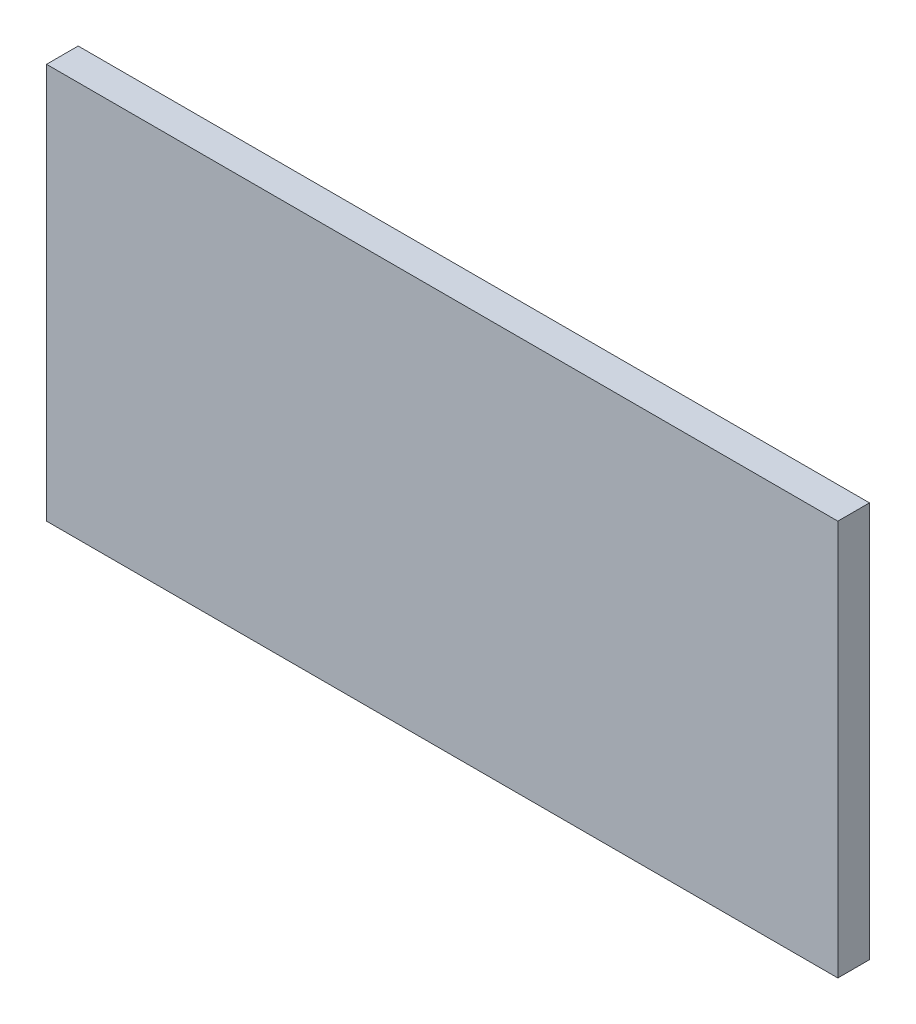
ISO-10303-21;
HEADER;
FILE_DESCRIPTION(('STEP AP214'),'2;1');
FILE_NAME('part.step','',(''),(''),'','','');
FILE_SCHEMA(('AUTOMOTIVE_DESIGN { 1 0 10303 214 1 1 1 1 }'));
ENDSEC;
DATA;
#1=APPLICATION_CONTEXT('core data for automotive mechanical design processes');
#2=APPLICATION_PROTOCOL_DEFINITION('international standard','automotive_design',2000,#1);
#3=PRODUCT_CONTEXT('',#1,'mechanical');
#4=PRODUCT('Part','Part','',(#3));
#5=PRODUCT_RELATED_PRODUCT_CATEGORY('part','',(#4));
#6=PRODUCT_DEFINITION_FORMATION('','',#4);
#7=PRODUCT_DEFINITION_CONTEXT('part definition',#1,'design');
#8=PRODUCT_DEFINITION('design','',#6,#7);
#9=PRODUCT_DEFINITION_SHAPE('','',#8);
#10=(LENGTH_UNIT() NAMED_UNIT(*) SI_UNIT(.MILLI.,.METRE.));
#11=(NAMED_UNIT(*) PLANE_ANGLE_UNIT() SI_UNIT($,.RADIAN.));
#12=(NAMED_UNIT(*) SI_UNIT($,.STERADIAN.) SOLID_ANGLE_UNIT());
#13=UNCERTAINTY_MEASURE_WITH_UNIT(LENGTH_MEASURE(1.E-05),#10,'distance_accuracy_value','');
#14=(GEOMETRIC_REPRESENTATION_CONTEXT(3) GLOBAL_UNCERTAINTY_ASSIGNED_CONTEXT((#13)) GLOBAL_UNIT_ASSIGNED_CONTEXT((#10,
#11,#12)) REPRESENTATION_CONTEXT('',''));
#15=CARTESIAN_POINT('',(0.,0.,0.));
#16=DIRECTION('',(0.,0.,1.));
#17=DIRECTION('',(1.,0.,0.));
#18=AXIS2_PLACEMENT_3D('',#15,#16,#17);
#19=CARTESIAN_POINT('',(250.,-125.,20.));
#20=DIRECTION('',(-1.,0.,0.));
#21=DIRECTION('',(0.,0.,1.));
#22=AXIS2_PLACEMENT_3D('',#19,#20,#21);
#23=PLANE('',#22);
#24=DIRECTION('',(0.,1.,0.));
#25=VECTOR('',#24,1.);
#26=CARTESIAN_POINT('',(250.,-125.,0.));
#27=LINE('',#26,#25);
#28=CARTESIAN_POINT('',(250.,-125.,0.));
#29=VERTEX_POINT('',#28);
#30=CARTESIAN_POINT('',(250.,125.,0.));
#31=VERTEX_POINT('',#30);
#32=EDGE_CURVE('E107',#29,#31,#27,.T.);
#33=ORIENTED_EDGE('',*,*,#32,.T.);
#34=DIRECTION('',(0.,0.,-1.));
#35=VECTOR('',#34,1.);
#36=CARTESIAN_POINT('',(250.,125.,20.));
#37=LINE('',#36,#35);
#38=CARTESIAN_POINT('',(250.,125.,20.));
#39=VERTEX_POINT('',#38);
#40=EDGE_CURVE('E11',#39,#31,#37,.T.);
#41=ORIENTED_EDGE('',*,*,#40,.F.);
#42=DIRECTION('',(0.,1.,0.));
#43=VECTOR('',#42,1.);
#44=CARTESIAN_POINT('',(250.,-125.,20.));
#45=LINE('',#44,#43);
#46=CARTESIAN_POINT('',(250.,-125.,20.));
#47=VERTEX_POINT('',#46);
#48=EDGE_CURVE('E91',#47,#39,#45,.T.);
#49=ORIENTED_EDGE('',*,*,#48,.F.);
#50=DIRECTION('',(0.,0.,-1.));
#51=VECTOR('',#50,1.);
#52=CARTESIAN_POINT('',(250.,-125.,20.));
#53=LINE('',#52,#51);
#54=EDGE_CURVE('E103',#47,#29,#53,.T.);
#55=ORIENTED_EDGE('',*,*,#54,.T.);
#56=EDGE_LOOP('',(#33,#41,#49,#55));
#57=FACE_BOUND('',#56,.T.);
#58=ADVANCED_FACE('F39',(#57),#23,.F.);
#59=CARTESIAN_POINT('',(-250.,125.,20.));
#60=DIRECTION('',(0.,-1.,0.));
#61=DIRECTION('',(0.,0.,-1.));
#62=AXIS2_PLACEMENT_3D('',#59,#60,#61);
#63=PLANE('',#62);
#64=DIRECTION('',(-1.,0.,0.));
#65=VECTOR('',#64,1.);
#66=CARTESIAN_POINT('',(-250.,125.,0.));
#67=LINE('',#66,#65);
#68=CARTESIAN_POINT('',(-250.,125.,0.));
#69=VERTEX_POINT('',#68);
#70=EDGE_CURVE('E96',#31,#69,#67,.T.);
#71=ORIENTED_EDGE('',*,*,#70,.T.);
#72=DIRECTION('',(0.,0.,-1.));
#73=VECTOR('',#72,1.);
#74=CARTESIAN_POINT('',(-250.,125.,20.));
#75=LINE('',#74,#73);
#76=CARTESIAN_POINT('',(-250.,125.,20.));
#77=VERTEX_POINT('',#76);
#78=EDGE_CURVE('E48',#77,#69,#75,.T.);
#79=ORIENTED_EDGE('',*,*,#78,.F.);
#80=DIRECTION('',(-1.,0.,0.));
#81=VECTOR('',#80,1.);
#82=CARTESIAN_POINT('',(-250.,125.,20.));
#83=LINE('',#82,#81);
#84=EDGE_CURVE('E86',#39,#77,#83,.T.);
#85=ORIENTED_EDGE('',*,*,#84,.F.);
#86=ORIENTED_EDGE('',*,*,#40,.T.);
#87=EDGE_LOOP('',(#71,#79,#85,#86));
#88=FACE_BOUND('',#87,.T.);
#89=ADVANCED_FACE('F95',(#88),#63,.F.);
#90=CARTESIAN_POINT('',(-250.,-125.,20.));
#91=DIRECTION('',(1.,0.,0.));
#92=DIRECTION('',(0.,0.,-1.));
#93=AXIS2_PLACEMENT_3D('',#90,#91,#92);
#94=PLANE('',#93);
#95=DIRECTION('',(0.,-1.,0.));
#96=VECTOR('',#95,1.);
#97=CARTESIAN_POINT('',(-250.,-125.,0.));
#98=LINE('',#97,#96);
#99=CARTESIAN_POINT('',(-250.,-125.,0.));
#100=VERTEX_POINT('',#99);
#101=EDGE_CURVE('E73',#69,#100,#98,.T.);
#102=ORIENTED_EDGE('',*,*,#101,.T.);
#103=DIRECTION('',(0.,0.,-1.));
#104=VECTOR('',#103,1.);
#105=CARTESIAN_POINT('',(-250.,-125.,20.));
#106=LINE('',#105,#104);
#107=CARTESIAN_POINT('',(-250.,-125.,20.));
#108=VERTEX_POINT('',#107);
#109=EDGE_CURVE('E98',#108,#100,#106,.T.);
#110=ORIENTED_EDGE('',*,*,#109,.F.);
#111=DIRECTION('',(0.,-1.,0.));
#112=VECTOR('',#111,1.);
#113=CARTESIAN_POINT('',(-250.,-125.,20.));
#114=LINE('',#113,#112);
#115=EDGE_CURVE('E89',#77,#108,#114,.T.);
#116=ORIENTED_EDGE('',*,*,#115,.F.);
#117=ORIENTED_EDGE('',*,*,#78,.T.);
#118=EDGE_LOOP('',(#102,#110,#116,#117));
#119=FACE_BOUND('',#118,.T.);
#120=ADVANCED_FACE('F99',(#119),#94,.F.);
#121=CARTESIAN_POINT('',(-250.,-125.,20.));
#122=DIRECTION('',(0.,1.,0.));
#123=DIRECTION('',(0.,0.,1.));
#124=AXIS2_PLACEMENT_3D('',#121,#122,#123);
#125=PLANE('',#124);
#126=DIRECTION('',(1.,0.,0.));
#127=VECTOR('',#126,1.);
#128=CARTESIAN_POINT('',(-250.,-125.,0.));
#129=LINE('',#128,#127);
#130=EDGE_CURVE('E79',#100,#29,#129,.T.);
#131=ORIENTED_EDGE('',*,*,#130,.T.);
#132=ORIENTED_EDGE('',*,*,#54,.F.);
#133=DIRECTION('',(1.,0.,0.));
#134=VECTOR('',#133,1.);
#135=CARTESIAN_POINT('',(-250.,-125.,20.));
#136=LINE('',#135,#134);
#137=EDGE_CURVE('E56',#108,#47,#136,.T.);
#138=ORIENTED_EDGE('',*,*,#137,.F.);
#139=ORIENTED_EDGE('',*,*,#109,.T.);
#140=EDGE_LOOP('',(#131,#132,#138,#139));
#141=FACE_BOUND('',#140,.T.);
#142=ADVANCED_FACE('F120',(#141),#125,.F.);
#143=CARTESIAN_POINT('',(0.,0.,20.));
#144=DIRECTION('',(0.,0.,-1.));
#145=DIRECTION('',(-1.,0.,0.));
#146=AXIS2_PLACEMENT_3D('',#143,#144,#145);
#147=PLANE('',#146);
#148=ORIENTED_EDGE('',*,*,#48,.T.);
#149=ORIENTED_EDGE('',*,*,#84,.T.);
#150=ORIENTED_EDGE('',*,*,#115,.T.);
#151=ORIENTED_EDGE('',*,*,#137,.T.);
#152=EDGE_LOOP('',(#148,#149,#150,#151));
#153=FACE_BOUND('',#152,.T.);
#154=ADVANCED_FACE('F87',(#153),#147,.F.);
#155=CARTESIAN_POINT('',(0.,0.,0.));
#156=DIRECTION('',(0.,0.,-1.));
#157=DIRECTION('',(-1.,0.,0.));
#158=AXIS2_PLACEMENT_3D('',#155,#156,#157);
#159=PLANE('',#158);
#160=ORIENTED_EDGE('',*,*,#32,.F.);
#161=ORIENTED_EDGE('',*,*,#130,.F.);
#162=ORIENTED_EDGE('',*,*,#101,.F.);
#163=ORIENTED_EDGE('',*,*,#70,.F.);
#164=EDGE_LOOP('',(#160,#161,#162,#163));
#165=FACE_BOUND('',#164,.T.);
#166=ADVANCED_FACE('F123',(#165),#159,.T.);
#167=CLOSED_SHELL('',(#58,#89,#120,#142,#154,#166));
#168=MANIFOLD_SOLID_BREP('B2',#167);
#169=ADVANCED_BREP_SHAPE_REPRESENTATION('',(#18,#168),#14);
#170=SHAPE_DEFINITION_REPRESENTATION(#9,#169);
ENDSEC;
END-ISO-10303-21;
